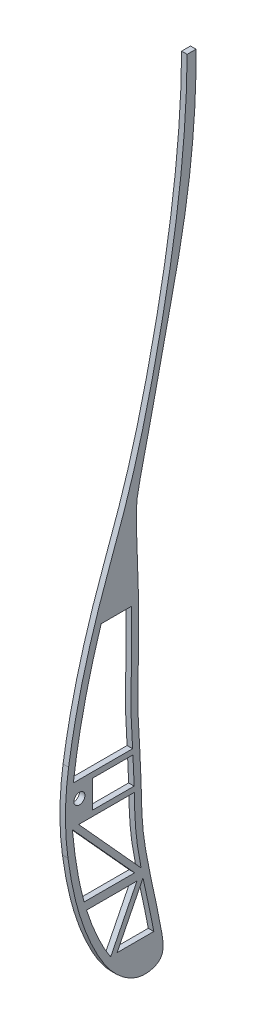
ISO-10303-21;
HEADER;
FILE_DESCRIPTION(('STEP AP214'),'2;1');
FILE_NAME('part.step','',(''),(''),'','','');
FILE_SCHEMA(('AUTOMOTIVE_DESIGN { 1 0 10303 214 1 1 1 1 }'));
ENDSEC;
DATA;
#1=APPLICATION_CONTEXT('core data for automotive mechanical design processes');
#2=APPLICATION_PROTOCOL_DEFINITION('international standard','automotive_design',2000,#1);
#3=PRODUCT_CONTEXT('',#1,'mechanical');
#4=PRODUCT('Part','Part','',(#3));
#5=PRODUCT_RELATED_PRODUCT_CATEGORY('part','',(#4));
#6=PRODUCT_DEFINITION_FORMATION('','',#4);
#7=PRODUCT_DEFINITION_CONTEXT('part definition',#1,'design');
#8=PRODUCT_DEFINITION('design','',#6,#7);
#9=PRODUCT_DEFINITION_SHAPE('','',#8);
#10=(LENGTH_UNIT() NAMED_UNIT(*) SI_UNIT(.MILLI.,.METRE.));
#11=(NAMED_UNIT(*) PLANE_ANGLE_UNIT() SI_UNIT($,.RADIAN.));
#12=(NAMED_UNIT(*) SI_UNIT($,.STERADIAN.) SOLID_ANGLE_UNIT());
#13=UNCERTAINTY_MEASURE_WITH_UNIT(LENGTH_MEASURE(1.E-05),#10,'distance_accuracy_value','');
#14=(GEOMETRIC_REPRESENTATION_CONTEXT(3) GLOBAL_UNCERTAINTY_ASSIGNED_CONTEXT((#13)) GLOBAL_UNIT_ASSIGNED_CONTEXT((#10,
#11,#12)) REPRESENTATION_CONTEXT('',''));
#15=CARTESIAN_POINT('',(0.,0.,0.));
#16=DIRECTION('',(0.,0.,1.));
#17=DIRECTION('',(1.,0.,0.));
#18=AXIS2_PLACEMENT_3D('',#15,#16,#17);
#19=CARTESIAN_POINT('',(2.,487.920198317946,-787.592315755189));
#20=DIRECTION('',(1.,0.,0.));
#21=DIRECTION('',(0.,0.,-1.));
#22=AXIS2_PLACEMENT_3D('',#19,#20,#21);
#23=PLANE('',#22);
#24=CARTESIAN_POINT('',(2.,340.385908262819,-765.512588052985));
#25=CARTESIAN_POINT('',(2.,339.008160637667,-765.942062452033));
#26=CARTESIAN_POINT('',(2.,335.196727706703,-767.22554902468));
#27=CARTESIAN_POINT('',(2.,330.291102646001,-769.261685790927));
#28=CARTESIAN_POINT('',(2.,325.640152405952,-771.608947919703));
#29=CARTESIAN_POINT('',(2.,323.059967565287,-773.096725597255));
#30=CARTESIAN_POINT('',(2.,321.674751511096,-774.004343098112));
#31=CARTESIAN_POINT('',(2.,321.355424184377,-774.220368212697));
#32=B_SPLINE_CURVE_WITH_KNOTS('',3,(#24,#25,#26,#27,#28,#29,#30,#31),.UNSPECIFIED.,.F.,.F.,(4,1,
1,1,1,4),(0.0697506622808374,0.0784831388022607,0.0941020686530699,0.101911533578474,
0.109720998503879,0.112105213874492),.UNSPECIFIED.);
#33=CARTESIAN_POINT('',(2.,340.385908262819,-765.512588052985));
#34=VERTEX_POINT('',#33);
#35=CARTESIAN_POINT('',(2.,321.355424184377,-774.220368212697));
#36=VERTEX_POINT('',#35);
#37=EDGE_CURVE('E254',#34,#36,#32,.T.);
#38=ORIENTED_EDGE('',*,*,#37,.F.);
#39=DIRECTION('',(0.,2.61948278448674E-13,1.));
#40=VECTOR('',#39,1.);
#41=CARTESIAN_POINT('',(2.,340.385908262819,-765.512588052985));
#42=LINE('',#41,#40);
#43=CARTESIAN_POINT('',(2.,340.385908262814,-783.737403402644));
#44=VERTEX_POINT('',#43);
#45=EDGE_CURVE('E262',#44,#34,#42,.T.);
#46=ORIENTED_EDGE('',*,*,#45,.F.);
#47=DIRECTION('',(0.,0.894393478705473,-0.447281013736468));
#48=VECTOR('',#47,1.);
#49=CARTESIAN_POINT('',(2.,340.385908262814,-783.737403402644));
#50=LINE('',#49,#48);
#51=EDGE_CURVE('E261',#36,#44,#50,.T.);
#52=ORIENTED_EDGE('',*,*,#51,.F.);
#53=EDGE_LOOP('',(#38,#46,#52));
#54=FACE_BOUND('',#53,.T.);
#55=DIRECTION('',(0.,0.740403338776906,0.672162849262));
#56=VECTOR('',#55,1.);
#57=CARTESIAN_POINT('',(2.,343.385908235926,-782.893255333231));
#58=LINE('',#57,#56);
#59=CARTESIAN_POINT('',(2.,343.385908235926,-782.893255333231));
#60=VERTEX_POINT('',#59);
#61=CARTESIAN_POINT('',(2.,368.21087997734,-760.356317876787));
#62=VERTEX_POINT('',#61);
#63=EDGE_CURVE('E294',#60,#62,#58,.T.);
#64=ORIENTED_EDGE('',*,*,#63,.F.);
#65=DIRECTION('',(0.,0.,-1.));
#66=VECTOR('',#65,1.);
#67=CARTESIAN_POINT('',(2.,343.385908235926,-764.629795023823));
#68=LINE('',#67,#66);
#69=CARTESIAN_POINT('',(2.,343.385908235926,-764.629795023823));
#70=VERTEX_POINT('',#69);
#71=EDGE_CURVE('E292',#70,#60,#68,.T.);
#72=ORIENTED_EDGE('',*,*,#71,.F.);
#73=CARTESIAN_POINT('',(2.,368.21087997734,-760.356317876787));
#74=CARTESIAN_POINT('',(2.,365.108328869822,-760.645542864691));
#75=CARTESIAN_POINT('',(2.,359.399798980375,-761.297099333512));
#76=CARTESIAN_POINT('',(2.,351.207948443267,-762.68556128646));
#77=CARTESIAN_POINT('',(2.,346.064289496861,-763.890877385841));
#78=CARTESIAN_POINT('',(2.,343.478926304313,-764.603996250646));
#79=CARTESIAN_POINT('',(2.,343.385908235926,-764.629795023823));
#80=B_SPLINE_CURVE_WITH_KNOTS('',3,(#73,#74,#75,#76,#77,#78,#79),.UNSPECIFIED.,.F.,.F.,(4,1,1,1,
4),(0.0131300298220132,0.0316263492498333,0.0472452791006425,0.0628642089514516,
0.0634474168728754),.UNSPECIFIED.);
#81=EDGE_CURVE('E298',#62,#70,#80,.T.);
#82=ORIENTED_EDGE('',*,*,#81,.F.);
#83=EDGE_LOOP('',(#64,#72,#82));
#84=FACE_BOUND('',#83,.T.);
#85=DIRECTION('',(0.,1.01853799677728E-12,1.));
#86=VECTOR('',#85,1.);
#87=CARTESIAN_POINT('',(2.,368.641580619222,-762.664726398492));
#88=LINE('',#87,#86);
#89=CARTESIAN_POINT('',(2.,368.641580619201,-782.775527241608));
#90=VERTEX_POINT('',#89);
#91=CARTESIAN_POINT('',(2.,368.641580619222,-762.664726398492));
#92=VERTEX_POINT('',#91);
#93=EDGE_CURVE('E341',#90,#92,#88,.T.);
#94=ORIENTED_EDGE('',*,*,#93,.F.);
#95=CARTESIAN_POINT('',(2.,343.762046236129,-785.235370081016));
#96=CARTESIAN_POINT('',(2.,345.435849463041,-784.911737530117));
#97=CARTESIAN_POINT('',(2.,348.412605531152,-784.369480265457));
#98=CARTESIAN_POINT('',(2.,352.846020065377,-783.683400446278));
#99=CARTESIAN_POINT('',(2.,358.350652792847,-783.092319970369));
#100=CARTESIAN_POINT('',(2.,363.61967757603,-782.886598012818));
#101=CARTESIAN_POINT('',(2.,367.500970974052,-782.801054430297));
#102=CARTESIAN_POINT('',(2.,368.641580619201,-782.775527241608));
#103=B_SPLINE_CURVE_WITH_KNOTS('',3,(#95,#96,#97,#98,#99,#100,#101,#102),.UNSPECIFIED.,.F.,.F.,
(4,1,1,1,1,4),(0.224345048321059,0.234672437310352,0.242481902235757,0.250291367161161,
0.26591029701197,0.272429812364704),.UNSPECIFIED.);
#104=CARTESIAN_POINT('',(2.,343.762046236129,-785.235370081016));
#105=VERTEX_POINT('',#104);
#106=EDGE_CURVE('E335',#105,#90,#103,.T.);
#107=ORIENTED_EDGE('',*,*,#106,.F.);
#108=DIRECTION('',(0.,-0.74063778163558,-0.671904514357454));
#109=VECTOR('',#108,1.);
#110=CARTESIAN_POINT('',(2.,343.762046236129,-785.235370081016));
#111=LINE('',#110,#109);
#112=EDGE_CURVE('E350',#92,#105,#111,.T.);
#113=ORIENTED_EDGE('',*,*,#112,.F.);
#114=EDGE_LOOP('',(#94,#107,#113));
#115=FACE_BOUND('',#114,.T.);
#116=DIRECTION('',(0.,-0.894393513688275,0.44728094378404));
#117=VECTOR('',#116,1.);
#118=CARTESIAN_POINT('',(2.,340.297979165982,-785.929582763325));
#119=LINE('',#118,#117);
#120=CARTESIAN_POINT('',(2.,340.297979165982,-785.929582763325));
#121=VERTEX_POINT('',#120);
#122=CARTESIAN_POINT('',(2.,321.529397961903,-776.543525523454));
#123=VERTEX_POINT('',#122);
#124=EDGE_CURVE('E379',#121,#123,#119,.T.);
#125=ORIENTED_EDGE('',*,*,#124,.F.);
#126=CARTESIAN_POINT('',(2.,321.529397961903,-789.845927053336));
#127=CARTESIAN_POINT('',(2.,321.699503823298,-789.814167011017));
#128=CARTESIAN_POINT('',(2.,322.038893566124,-789.750428920361));
#129=CARTESIAN_POINT('',(2.,323.580698572305,-789.457737754349));
#130=CARTESIAN_POINT('',(2.,326.240421286965,-788.929454000009));
#131=CARTESIAN_POINT('',(2.,329.952624524179,-788.149638114499));
#132=CARTESIAN_POINT('',(2.,333.72403688345,-787.332530561591));
#133=CARTESIAN_POINT('',(2.,337.157851053267,-786.588165074445));
#134=CARTESIAN_POINT('',(2.,339.349407118532,-786.125599329134));
#135=CARTESIAN_POINT('',(2.,340.297979165982,-785.929582763325));
#136=B_SPLINE_CURVE_WITH_KNOTS('',3,(#126,#127,#128,#129,#130,#131,#132,#133,#134,#135),
.UNSPECIFIED.,.F.,.F.,(4,1,1,1,1,1,1,4),(0.178917784035079,0.179893967151298,0.180870150266974,
0.187815647757925,0.195625112683329,0.203434577608734,0.211244042534138,0.217170107358208),.UNSPECIFIED.);
#137=CARTESIAN_POINT('',(2.,321.529397961903,-789.845927053336));
#138=VERTEX_POINT('',#137);
#139=EDGE_CURVE('E374',#138,#121,#136,.T.);
#140=ORIENTED_EDGE('',*,*,#139,.F.);
#141=DIRECTION('',(0.,0.,-1.));
#142=VECTOR('',#141,1.);
#143=CARTESIAN_POINT('',(2.,321.529397961903,-776.543525523454));
#144=LINE('',#143,#142);
#145=EDGE_CURVE('E513',#123,#138,#144,.T.);
#146=ORIENTED_EDGE('',*,*,#145,.F.);
#147=EDGE_LOOP('',(#125,#140,#146));
#148=FACE_BOUND('',#147,.T.);
#149=DIRECTION('',(0.,0.,-1.));
#150=VECTOR('',#149,1.);
#151=CARTESIAN_POINT('',(2.,382.641580619201,-760.713816226627));
#152=LINE('',#151,#150);
#153=CARTESIAN_POINT('',(2.,382.641580619201,-760.713816226627));
#154=VERTEX_POINT('',#153);
#155=CARTESIAN_POINT('',(2.,382.641580619201,-782.158524772029));
#156=VERTEX_POINT('',#155);
#157=EDGE_CURVE('E410',#154,#156,#152,.T.);
#158=ORIENTED_EDGE('',*,*,#157,.F.);
#159=CARTESIAN_POINT('',(2.,427.491820966125,-770.78664309846));
#160=CARTESIAN_POINT('',(2.,423.33866525662,-769.467056163945));
#161=CARTESIAN_POINT('',(2.,414.7700614056,-766.964736871384));
#162=CARTESIAN_POINT('',(2.,399.851527625685,-763.380449780048));
#163=CARTESIAN_POINT('',(2.,389.014059475878,-761.525068294202));
#164=CARTESIAN_POINT('',(2.,382.641580619201,-760.713816226627));
#165=B_SPLINE_CURVE_WITH_KNOTS('',3,(#159,#160,#161,#162,#163,#164),.UNSPECIFIED.,.F.,.F.,(4,1,
1,4),(0.75216752707801,0.811772657665889,0.874216708255573,0.962264248056751),.UNSPECIFIED.);
#166=CARTESIAN_POINT('',(2.,427.491820966125,-770.78664309846));
#167=VERTEX_POINT('',#166);
#168=EDGE_CURVE('E440',#167,#154,#165,.T.);
#169=ORIENTED_EDGE('',*,*,#168,.F.);
#170=DIRECTION('',(0.,0.,1.));
#171=VECTOR('',#170,1.);
#172=CARTESIAN_POINT('',(2.,427.491820966125,-770.78664309846));
#173=LINE('',#172,#171);
#174=CARTESIAN_POINT('',(2.,427.491820966125,-781.8143913991));
#175=VERTEX_POINT('',#174);
#176=EDGE_CURVE('E409',#175,#167,#173,.T.);
#177=ORIENTED_EDGE('',*,*,#176,.F.);
#178=CARTESIAN_POINT('',(2.,382.641580619201,-782.158524772029));
#179=CARTESIAN_POINT('',(2.,384.984999743043,-782.009801346982));
#180=CARTESIAN_POINT('',(2.,392.72879678058,-781.532269832097));
#181=CARTESIAN_POINT('',(2.,402.504492041581,-781.601558596643));
#182=CARTESIAN_POINT('',(2.,413.028444882909,-781.812144771197));
#183=CARTESIAN_POINT('',(2.,420.046613203179,-781.889539878955));
#184=CARTESIAN_POINT('',(2.,425.00787778219,-781.856336873659));
#185=CARTESIAN_POINT('',(2.,427.030653456843,-781.822920811895));
#186=CARTESIAN_POINT('',(2.,427.491820966125,-781.8143913991));
#187=B_SPLINE_CURVE_WITH_KNOTS('',3,(#178,#179,#180,#181,#182,#183,#184,#185,#186),
.UNSPECIFIED.,.F.,.F.,(4,1,1,1,1,1,4),(0.299279434855956,0.312767086564398,0.344004946266016,
0.359623876116825,0.375242805967634,0.383052270893039,0.385336265488092),.UNSPECIFIED.);
#188=EDGE_CURVE('E402',#156,#175,#187,.T.);
#189=ORIENTED_EDGE('',*,*,#188,.F.);
#190=EDGE_LOOP('',(#158,#169,#177,#189));
#191=FACE_BOUND('',#190,.T.);
#192=CARTESIAN_POINT('',(2.,590.408064710771,-801.906188373582));
#193=CARTESIAN_POINT('',(2.,560.152088887288,-801.696570251293));
#194=CARTESIAN_POINT('',(2.,516.437326180136,-794.99876359232));
#195=CARTESIAN_POINT('',(2.,464.922101840584,-781.936935881535));
#196=CARTESIAN_POINT('',(2.,434.335812649186,-769.954968016458));
#197=CARTESIAN_POINT('',(2.,410.299032990524,-762.960296942413));
#198=CARTESIAN_POINT('',(2.,394.5014570022,-759.91934012317));
#199=CARTESIAN_POINT('',(2.,388.426895833706,-758.997230435459));
#200=B_SPLINE_CURVE_WITH_KNOTS('',3,(#192,#193,#194,#195,#196,#197,#198,#199),.UNSPECIFIED.,.F.,
.F.,(4,1,1,1,1,4),(0.,0.408822914051853,0.598513203717909,0.719261823921423,0.854060705268453,
0.937350513563484),.UNSPECIFIED.);
#201=CARTESIAN_POINT('',(2.,590.408064710771,-801.906188373582));
#202=VERTEX_POINT('',#201);
#203=CARTESIAN_POINT('',(2.,388.426895833706,-758.997230435459));
#204=VERTEX_POINT('',#203);
#205=EDGE_CURVE('E450',#202,#204,#200,.T.);
#206=ORIENTED_EDGE('',*,*,#205,.T.);
#207=CARTESIAN_POINT('',(2.,373.418966627961,-857.864626785092));
#208=DIRECTION('',(1.,0.,0.));
#209=DIRECTION('',(0.,0.,-1.));
#210=AXIS2_PLACEMENT_3D('',#207,#208,#209);
#211=CIRCLE('',#210,100.);
#212=CARTESIAN_POINT('',(2.,360.06570641665,-758.760184696308));
#213=VERTEX_POINT('',#212);
#214=EDGE_CURVE('E456',#204,#213,#211,.T.);
#215=ORIENTED_EDGE('',*,*,#214,.T.);
#216=CARTESIAN_POINT('',(2.,360.06570641665,-758.760184696308));
#217=CARTESIAN_POINT('',(2.,354.912593588328,-759.454511358611));
#218=CARTESIAN_POINT('',(2.,342.91803163055,-761.639215143785));
#219=CARTESIAN_POINT('',(2.,326.356505876886,-767.602503807591));
#220=CARTESIAN_POINT('',(2.,313.183311775306,-776.364446291571));
#221=CARTESIAN_POINT('',(2.,308.841980468107,-785.880697371213));
#222=CARTESIAN_POINT('',(2.,310.610251685068,-791.313928595472));
#223=CARTESIAN_POINT('',(2.,312.987941846461,-793.075385029442));
#224=CARTESIAN_POINT('',(2.,316.107743129073,-793.337462446663));
#225=CARTESIAN_POINT('',(2.,329.643146103394,-791.041438182055));
#226=CARTESIAN_POINT('',(2.,341.196605560739,-787.95599236507));
#227=CARTESIAN_POINT('',(2.,359.620713161168,-785.204159750693));
#228=CARTESIAN_POINT('',(2.,372.997065252505,-785.453788794671));
#229=CARTESIAN_POINT('',(2.,397.430131693857,-783.431517771397));
#230=CARTESIAN_POINT('',(2.,420.762517316124,-785.24761534817));
#231=CARTESIAN_POINT('',(2.,455.809656019197,-783.053458862603));
#232=CARTESIAN_POINT('',(2.,464.386743167617,-784.469445240221));
#233=CARTESIAN_POINT('',(2.,479.293540681458,-788.132816832003));
#234=CARTESIAN_POINT('',(2.,503.980467437628,-793.242767846079));
#235=CARTESIAN_POINT('',(2.,542.605359529919,-802.54005693684));
#236=CARTESIAN_POINT('',(2.,572.394099522504,-805.258661066609));
#237=CARTESIAN_POINT('',(2.,590.408064710771,-805.114959311522));
#238=B_SPLINE_CURVE_WITH_KNOTS('',3,(#216,#217,#218,#219,#220,#221,#222,#223,#224,#225,#226,
#227,#228,#229,#230,#231,#232,#233,#234,#235,#236,#237),.UNSPECIFIED.,.F.,.F.,(4,1,1,1,1,1,1,1,
1,1,1,1,1,1,1,1,1,1,1,4),(0.0287053793644798,0.0592468566198316,0.100347506498937,
0.132199535267225,0.149145767340533,0.158795902968277,0.160733944755249,0.167660380715246,
0.175846516855138,0.234409170014273,0.24607012832152,0.285135768282719,0.310616456213291,
0.385264397934258,0.441942427351935,0.454032525104892,0.506165375463829,0.624061375943607,
0.777474310688583,1.),.UNSPECIFIED.);
#239=CARTESIAN_POINT('',(2.,590.408064710771,-805.114959311522));
#240=VERTEX_POINT('',#239);
#241=EDGE_CURVE('E462',#213,#240,#238,.T.);
#242=ORIENTED_EDGE('',*,*,#241,.T.);
#243=DIRECTION('',(0.,0.,1.));
#244=VECTOR('',#243,1.);
#245=CARTESIAN_POINT('',(2.,590.408064710771,-801.906188373582));
#246=LINE('',#245,#244);
#247=EDGE_CURVE('E467',#240,#202,#246,.T.);
#248=ORIENTED_EDGE('',*,*,#247,.T.);
#249=EDGE_LOOP('',(#206,#215,#242,#248));
#250=FACE_BOUND('',#249,.T.);
#251=CARTESIAN_POINT('',(2.,376.641580619201,-762.916566478433));
#252=DIRECTION('',(1.,0.,0.));
#253=DIRECTION('',(0.,0.,-1.));
#254=AXIS2_PLACEMENT_3D('',#251,#252,#253);
#255=CIRCLE('',#254,2.);
#256=CARTESIAN_POINT('',(2.,376.641580619201,-764.916566478433));
#257=VERTEX_POINT('',#256);
#258=EDGE_CURVE('E273',#257,#257,#255,.T.);
#259=ORIENTED_EDGE('',*,*,#258,.F.);
#260=EDGE_LOOP('',(#259));
#261=FACE_BOUND('',#260,.T.);
#262=DIRECTION('',(0.,-1.,0.));
#263=VECTOR('',#262,1.);
#264=CARTESIAN_POINT('',(2.,380.641580619201,-767.571939026823));
#265=LINE('',#264,#263);
#266=CARTESIAN_POINT('',(2.,380.641580619201,-767.571939026823));
#267=VERTEX_POINT('',#266);
#268=CARTESIAN_POINT('',(2.,370.641580619201,-767.571939026823));
#269=VERTEX_POINT('',#268);
#270=EDGE_CURVE('E202',#267,#269,#265,.T.);
#271=ORIENTED_EDGE('',*,*,#270,.F.);
#272=DIRECTION('',(0.,0.,1.));
#273=VECTOR('',#272,1.);
#274=CARTESIAN_POINT('',(2.,380.641580619201,-767.571939026823));
#275=LINE('',#274,#273);
#276=CARTESIAN_POINT('',(2.,380.641580619201,-782.28548229842));
#277=VERTEX_POINT('',#276);
#278=EDGE_CURVE('E194',#277,#267,#275,.T.);
#279=ORIENTED_EDGE('',*,*,#278,.F.);
#280=CARTESIAN_POINT('',(2.,370.641580619201,-782.729137506047));
#281=CARTESIAN_POINT('',(2.,371.563392328796,-782.706435659239));
#282=CARTESIAN_POINT('',(2.,373.842636010294,-782.643817690012));
#283=CARTESIAN_POINT('',(2.,377.160810260957,-782.499614967796));
#284=CARTESIAN_POINT('',(2.,379.579890206761,-782.352274740881));
#285=CARTESIAN_POINT('',(2.,380.641580619201,-782.28548229842));
#286=B_SPLINE_CURVE_WITH_KNOTS('',3,(#280,#281,#282,#283,#284,#285),.UNSPECIFIED.,.F.,.F.,(4,1,
1,4),(0.276245485102746,0.28152922686278,0.289338691788184,0.295444603811265),.UNSPECIFIED.);
#287=CARTESIAN_POINT('',(2.,370.641580619201,-782.729137506047));
#288=VERTEX_POINT('',#287);
#289=EDGE_CURVE('E216',#288,#277,#286,.T.);
#290=ORIENTED_EDGE('',*,*,#289,.F.);
#291=DIRECTION('',(0.,0.,-1.));
#292=VECTOR('',#291,1.);
#293=CARTESIAN_POINT('',(2.,370.641580619201,-767.571939026823));
#294=LINE('',#293,#292);
#295=EDGE_CURVE('E214',#269,#288,#294,.T.);
#296=ORIENTED_EDGE('',*,*,#295,.F.);
#297=EDGE_LOOP('',(#271,#279,#290,#296));
#298=FACE_BOUND('',#297,.T.);
#299=ADVANCED_FACE('F32',(#54,#84,#115,#148,#191,#250,#261,#298),#23,.T.);
#300=CARTESIAN_POINT('',(0.,487.920198317946,-787.592315755189));
#301=DIRECTION('',(1.,0.,0.));
#302=DIRECTION('',(0.,0.,-1.));
#303=AXIS2_PLACEMENT_3D('',#300,#301,#302);
#304=PLANE('',#303);
#305=CARTESIAN_POINT('',(0.,376.641580619201,-762.916566478433));
#306=DIRECTION('',(1.,0.,0.));
#307=DIRECTION('',(0.,0.,-1.));
#308=AXIS2_PLACEMENT_3D('',#305,#306,#307);
#309=CIRCLE('',#308,2.);
#310=CARTESIAN_POINT('',(0.,376.641580619201,-764.916566478433));
#311=VERTEX_POINT('',#310);
#312=EDGE_CURVE('E210',#311,#311,#309,.T.);
#313=ORIENTED_EDGE('',*,*,#312,.T.);
#314=EDGE_LOOP('',(#313));
#315=FACE_BOUND('',#314,.T.);
#316=DIRECTION('',(0.,2.61948278448674E-13,1.));
#317=VECTOR('',#316,1.);
#318=CARTESIAN_POINT('',(0.,340.385908262819,-765.512588052985));
#319=LINE('',#318,#317);
#320=CARTESIAN_POINT('',(0.,340.385908262814,-783.737403402644));
#321=VERTEX_POINT('',#320);
#322=CARTESIAN_POINT('',(0.,340.385908262819,-765.512588052985));
#323=VERTEX_POINT('',#322);
#324=EDGE_CURVE('E269',#321,#323,#319,.T.);
#325=ORIENTED_EDGE('',*,*,#324,.T.);
#326=CARTESIAN_POINT('',(0.,340.385908262819,-765.512588052985));
#327=CARTESIAN_POINT('',(0.,339.008160637667,-765.942062452033));
#328=CARTESIAN_POINT('',(0.,335.196727706703,-767.22554902468));
#329=CARTESIAN_POINT('',(0.,330.291102646001,-769.261685790927));
#330=CARTESIAN_POINT('',(0.,325.640152405952,-771.608947919703));
#331=CARTESIAN_POINT('',(0.,323.059967565287,-773.096725597255));
#332=CARTESIAN_POINT('',(0.,321.674751511096,-774.004343098112));
#333=CARTESIAN_POINT('',(0.,321.355424184377,-774.220368212697));
#334=B_SPLINE_CURVE_WITH_KNOTS('',3,(#326,#327,#328,#329,#330,#331,#332,#333),.UNSPECIFIED.,.F.,
.F.,(4,1,1,1,1,4),(0.0697506622808374,0.0784831388022607,0.0941020686530699,0.101911533578474,
0.109720998503879,0.112105213874492),.UNSPECIFIED.);
#335=CARTESIAN_POINT('',(0.,321.355424184377,-774.220368212697));
#336=VERTEX_POINT('',#335);
#337=EDGE_CURVE('E272',#323,#336,#334,.T.);
#338=ORIENTED_EDGE('',*,*,#337,.T.);
#339=DIRECTION('',(0.,0.894393478705473,-0.447281013736468));
#340=VECTOR('',#339,1.);
#341=CARTESIAN_POINT('',(0.,340.385908262814,-783.737403402644));
#342=LINE('',#341,#340);
#343=EDGE_CURVE('E278',#336,#321,#342,.T.);
#344=ORIENTED_EDGE('',*,*,#343,.T.);
#345=EDGE_LOOP('',(#325,#338,#344));
#346=FACE_BOUND('',#345,.T.);
#347=CARTESIAN_POINT('',(0.,343.762046236129,-785.235370081016));
#348=CARTESIAN_POINT('',(0.,345.435849463041,-784.911737530117));
#349=CARTESIAN_POINT('',(0.,348.412605531152,-784.369480265457));
#350=CARTESIAN_POINT('',(0.,352.846020065377,-783.683400446278));
#351=CARTESIAN_POINT('',(0.,358.350652792847,-783.092319970369));
#352=CARTESIAN_POINT('',(0.,363.61967757603,-782.886598012818));
#353=CARTESIAN_POINT('',(0.,367.500970974052,-782.801054430297));
#354=CARTESIAN_POINT('',(0.,368.641580619201,-782.775527241608));
#355=B_SPLINE_CURVE_WITH_KNOTS('',3,(#347,#348,#349,#350,#351,#352,#353,#354),.UNSPECIFIED.,.F.,
.F.,(4,1,1,1,1,4),(0.224345048321059,0.234672437310352,0.242481902235757,0.250291367161161,
0.26591029701197,0.272429812364704),.UNSPECIFIED.);
#356=CARTESIAN_POINT('',(0.,343.762046236129,-785.235370081016));
#357=VERTEX_POINT('',#356);
#358=CARTESIAN_POINT('',(0.,368.641580619201,-782.775527241608));
#359=VERTEX_POINT('',#358);
#360=EDGE_CURVE('E353',#357,#359,#355,.T.);
#361=ORIENTED_EDGE('',*,*,#360,.T.);
#362=DIRECTION('',(0.,1.01853799677728E-12,1.));
#363=VECTOR('',#362,1.);
#364=CARTESIAN_POINT('',(0.,368.641580619222,-762.664726398492));
#365=LINE('',#364,#363);
#366=CARTESIAN_POINT('',(0.,368.641580619222,-762.664726398492));
#367=VERTEX_POINT('',#366);
#368=EDGE_CURVE('E358',#359,#367,#365,.T.);
#369=ORIENTED_EDGE('',*,*,#368,.T.);
#370=DIRECTION('',(0.,-0.74063778163558,-0.671904514357454));
#371=VECTOR('',#370,1.);
#372=CARTESIAN_POINT('',(0.,343.762046236129,-785.235370081016));
#373=LINE('',#372,#371);
#374=EDGE_CURVE('E342',#367,#357,#373,.T.);
#375=ORIENTED_EDGE('',*,*,#374,.T.);
#376=EDGE_LOOP('',(#361,#369,#375));
#377=FACE_BOUND('',#376,.T.);
#378=CARTESIAN_POINT('',(0.,427.491820966125,-770.78664309846));
#379=CARTESIAN_POINT('',(0.,423.33866525662,-769.467056163945));
#380=CARTESIAN_POINT('',(0.,414.7700614056,-766.964736871384));
#381=CARTESIAN_POINT('',(0.,399.851527625685,-763.380449780048));
#382=CARTESIAN_POINT('',(0.,389.014059475878,-761.525068294202));
#383=CARTESIAN_POINT('',(0.,382.641580619201,-760.713816226627));
#384=B_SPLINE_CURVE_WITH_KNOTS('',3,(#378,#379,#380,#381,#382,#383),.UNSPECIFIED.,.F.,.F.,(4,1,
1,4),(0.75216752707801,0.811772657665889,0.874216708255573,0.962264248056751),.UNSPECIFIED.);
#385=CARTESIAN_POINT('',(0.,427.491820966125,-770.78664309846));
#386=VERTEX_POINT('',#385);
#387=CARTESIAN_POINT('',(0.,382.641580619201,-760.713816226627));
#388=VERTEX_POINT('',#387);
#389=EDGE_CURVE('E417',#386,#388,#384,.T.);
#390=ORIENTED_EDGE('',*,*,#389,.T.);
#391=DIRECTION('',(0.,0.,-1.));
#392=VECTOR('',#391,1.);
#393=CARTESIAN_POINT('',(0.,382.641580619201,-760.713816226627));
#394=LINE('',#393,#392);
#395=CARTESIAN_POINT('',(0.,382.641580619201,-782.158524772029));
#396=VERTEX_POINT('',#395);
#397=EDGE_CURVE('E422',#388,#396,#394,.T.);
#398=ORIENTED_EDGE('',*,*,#397,.T.);
#399=CARTESIAN_POINT('',(0.,382.641580619201,-782.158524772029));
#400=CARTESIAN_POINT('',(0.,384.984999743043,-782.009801346982));
#401=CARTESIAN_POINT('',(0.,392.72879678058,-781.532269832097));
#402=CARTESIAN_POINT('',(0.,402.504492041581,-781.601558596643));
#403=CARTESIAN_POINT('',(0.,413.028444882909,-781.812144771197));
#404=CARTESIAN_POINT('',(0.,420.046613203179,-781.889539878955));
#405=CARTESIAN_POINT('',(0.,425.00787778219,-781.856336873659));
#406=CARTESIAN_POINT('',(0.,427.030653456843,-781.822920811895));
#407=CARTESIAN_POINT('',(0.,427.491820966125,-781.8143913991));
#408=B_SPLINE_CURVE_WITH_KNOTS('',3,(#399,#400,#401,#402,#403,#404,#405,#406,#407),
.UNSPECIFIED.,.F.,.F.,(4,1,1,1,1,1,4),(0.299279434855956,0.312767086564398,0.344004946266016,
0.359623876116825,0.375242805967634,0.383052270893039,0.385336265488092),.UNSPECIFIED.);
#409=CARTESIAN_POINT('',(0.,427.491820966125,-781.8143913991));
#410=VERTEX_POINT('',#409);
#411=EDGE_CURVE('E429',#396,#410,#408,.T.);
#412=ORIENTED_EDGE('',*,*,#411,.T.);
#413=DIRECTION('',(0.,0.,1.));
#414=VECTOR('',#413,1.);
#415=CARTESIAN_POINT('',(0.,427.491820966125,-770.78664309846));
#416=LINE('',#415,#414);
#417=EDGE_CURVE('E434',#410,#386,#416,.T.);
#418=ORIENTED_EDGE('',*,*,#417,.T.);
#419=EDGE_LOOP('',(#390,#398,#412,#418));
#420=FACE_BOUND('',#419,.T.);
#421=CARTESIAN_POINT('',(0.,590.408064710771,-801.906188373582));
#422=CARTESIAN_POINT('',(0.,560.152088887288,-801.696570251293));
#423=CARTESIAN_POINT('',(0.,516.437326180136,-794.99876359232));
#424=CARTESIAN_POINT('',(0.,464.922101840584,-781.936935881535));
#425=CARTESIAN_POINT('',(0.,434.335812649186,-769.954968016458));
#426=CARTESIAN_POINT('',(0.,410.299032990524,-762.960296942413));
#427=CARTESIAN_POINT('',(0.,394.5014570022,-759.91934012317));
#428=CARTESIAN_POINT('',(0.,388.426895833706,-758.997230435459));
#429=B_SPLINE_CURVE_WITH_KNOTS('',3,(#421,#422,#423,#424,#425,#426,#427,#428),.UNSPECIFIED.,.F.,
.F.,(4,1,1,1,1,4),(0.,0.408822914051853,0.598513203717909,0.719261823921423,0.854060705268453,
0.937350513563484),.UNSPECIFIED.);
#430=CARTESIAN_POINT('',(0.,590.408064710771,-801.906188373582));
#431=VERTEX_POINT('',#430);
#432=CARTESIAN_POINT('',(0.,388.426895833706,-758.997230435459));
#433=VERTEX_POINT('',#432);
#434=EDGE_CURVE('E449',#431,#433,#429,.T.);
#435=ORIENTED_EDGE('',*,*,#434,.F.);
#436=DIRECTION('',(0.,0.,1.));
#437=VECTOR('',#436,1.);
#438=CARTESIAN_POINT('',(0.,590.408064710771,-801.906188373582));
#439=LINE('',#438,#437);
#440=CARTESIAN_POINT('',(0.,590.408064710771,-805.114959311522));
#441=VERTEX_POINT('',#440);
#442=EDGE_CURVE('E457',#441,#431,#439,.T.);
#443=ORIENTED_EDGE('',*,*,#442,.F.);
#444=CARTESIAN_POINT('',(0.,360.06570641665,-758.760184696308));
#445=CARTESIAN_POINT('',(0.,354.912593588328,-759.454511358611));
#446=CARTESIAN_POINT('',(0.,342.91803163055,-761.639215143785));
#447=CARTESIAN_POINT('',(0.,326.356505876886,-767.602503807591));
#448=CARTESIAN_POINT('',(0.,313.183311775306,-776.364446291571));
#449=CARTESIAN_POINT('',(0.,308.841980468107,-785.880697371213));
#450=CARTESIAN_POINT('',(0.,310.610251685068,-791.313928595472));
#451=CARTESIAN_POINT('',(0.,312.987941846461,-793.075385029442));
#452=CARTESIAN_POINT('',(0.,316.107743129073,-793.337462446663));
#453=CARTESIAN_POINT('',(0.,329.643146103394,-791.041438182055));
#454=CARTESIAN_POINT('',(0.,341.196605560739,-787.95599236507));
#455=CARTESIAN_POINT('',(0.,359.620713161168,-785.204159750693));
#456=CARTESIAN_POINT('',(0.,372.997065252505,-785.453788794671));
#457=CARTESIAN_POINT('',(0.,397.430131693857,-783.431517771397));
#458=CARTESIAN_POINT('',(0.,420.762517316124,-785.24761534817));
#459=CARTESIAN_POINT('',(0.,455.809656019197,-783.053458862603));
#460=CARTESIAN_POINT('',(0.,464.386743167617,-784.469445240221));
#461=CARTESIAN_POINT('',(0.,479.293540681458,-788.132816832003));
#462=CARTESIAN_POINT('',(0.,503.980467437628,-793.242767846079));
#463=CARTESIAN_POINT('',(0.,542.605359529919,-802.54005693684));
#464=CARTESIAN_POINT('',(0.,572.394099522504,-805.258661066609));
#465=CARTESIAN_POINT('',(0.,590.408064710771,-805.114959311522));
#466=B_SPLINE_CURVE_WITH_KNOTS('',3,(#444,#445,#446,#447,#448,#449,#450,#451,#452,#453,#454,
#455,#456,#457,#458,#459,#460,#461,#462,#463,#464,#465),.UNSPECIFIED.,.F.,.F.,(4,1,1,1,1,1,1,1,
1,1,1,1,1,1,1,1,1,1,1,4),(0.0287053793644798,0.0592468566198316,0.100347506498937,
0.132199535267225,0.149145767340533,0.158795902968277,0.160733944755249,0.167660380715246,
0.175846516855138,0.234409170014273,0.24607012832152,0.285135768282719,0.310616456213291,
0.385264397934258,0.441942427351935,0.454032525104892,0.506165375463829,0.624061375943607,
0.777474310688583,1.),.UNSPECIFIED.);
#467=CARTESIAN_POINT('',(0.,360.06570641665,-758.760184696308));
#468=VERTEX_POINT('',#467);
#469=EDGE_CURVE('E571',#468,#441,#466,.T.);
#470=ORIENTED_EDGE('',*,*,#469,.F.);
#471=CARTESIAN_POINT('',(0.,373.418966627961,-857.864626785092));
#472=DIRECTION('',(1.,0.,0.));
#473=DIRECTION('',(0.,0.,-1.));
#474=AXIS2_PLACEMENT_3D('',#471,#472,#473);
#475=CIRCLE('',#474,100.);
#476=EDGE_CURVE('E568',#433,#468,#475,.T.);
#477=ORIENTED_EDGE('',*,*,#476,.F.);
#478=EDGE_LOOP('',(#435,#443,#470,#477));
#479=FACE_BOUND('',#478,.T.);
#480=CARTESIAN_POINT('',(0.,321.529397961903,-789.845927053336));
#481=CARTESIAN_POINT('',(0.,321.699503823298,-789.814167011017));
#482=CARTESIAN_POINT('',(0.,322.038893566124,-789.750428920361));
#483=CARTESIAN_POINT('',(0.,323.580698572305,-789.457737754349));
#484=CARTESIAN_POINT('',(0.,326.240421286965,-788.929454000009));
#485=CARTESIAN_POINT('',(0.,329.952624524179,-788.149638114499));
#486=CARTESIAN_POINT('',(0.,333.72403688345,-787.332530561591));
#487=CARTESIAN_POINT('',(0.,337.157851053267,-786.588165074445));
#488=CARTESIAN_POINT('',(0.,339.349407118532,-786.125599329134));
#489=CARTESIAN_POINT('',(0.,340.297979165982,-785.929582763325));
#490=B_SPLINE_CURVE_WITH_KNOTS('',3,(#480,#481,#482,#483,#484,#485,#486,#487,#488,#489),
.UNSPECIFIED.,.F.,.F.,(4,1,1,1,1,1,1,4),(0.178917784035079,0.179893967151298,0.180870150266974,
0.187815647757925,0.195625112683329,0.203434577608734,0.211244042534138,0.217170107358208),.UNSPECIFIED.);
#491=CARTESIAN_POINT('',(0.,321.529397961903,-789.845927053336));
#492=VERTEX_POINT('',#491);
#493=CARTESIAN_POINT('',(0.,340.297979165982,-785.929582763325));
#494=VERTEX_POINT('',#493);
#495=EDGE_CURVE('E373',#492,#494,#490,.T.);
#496=ORIENTED_EDGE('',*,*,#495,.T.);
#497=DIRECTION('',(0.,-0.894393513688275,0.44728094378404));
#498=VECTOR('',#497,1.);
#499=CARTESIAN_POINT('',(0.,340.297979165982,-785.929582763325));
#500=LINE('',#499,#498);
#501=CARTESIAN_POINT('',(0.,321.529397961903,-776.543525523454));
#502=VERTEX_POINT('',#501);
#503=EDGE_CURVE('E516',#494,#502,#500,.T.);
#504=ORIENTED_EDGE('',*,*,#503,.T.);
#505=DIRECTION('',(0.,0.,-1.));
#506=VECTOR('',#505,1.);
#507=CARTESIAN_POINT('',(0.,321.529397961903,-776.543525523454));
#508=LINE('',#507,#506);
#509=EDGE_CURVE('E380',#502,#492,#508,.T.);
#510=ORIENTED_EDGE('',*,*,#509,.T.);
#511=EDGE_LOOP('',(#496,#504,#510));
#512=FACE_BOUND('',#511,.T.);
#513=DIRECTION('',(0.,0.,-1.));
#514=VECTOR('',#513,1.);
#515=CARTESIAN_POINT('',(0.,343.385908235926,-764.629795023823));
#516=LINE('',#515,#514);
#517=CARTESIAN_POINT('',(0.,343.385908235926,-764.629795023823));
#518=VERTEX_POINT('',#517);
#519=CARTESIAN_POINT('',(0.,343.385908235926,-782.893255333231));
#520=VERTEX_POINT('',#519);
#521=EDGE_CURVE('E291',#518,#520,#516,.T.);
#522=ORIENTED_EDGE('',*,*,#521,.T.);
#523=DIRECTION('',(0.,0.740403338776906,0.672162849262));
#524=VECTOR('',#523,1.);
#525=CARTESIAN_POINT('',(0.,343.385908235926,-782.893255333231));
#526=LINE('',#525,#524);
#527=CARTESIAN_POINT('',(0.,368.21087997734,-760.356317876787));
#528=VERTEX_POINT('',#527);
#529=EDGE_CURVE('E788',#520,#528,#526,.T.);
#530=ORIENTED_EDGE('',*,*,#529,.T.);
#531=CARTESIAN_POINT('',(0.,368.21087997734,-760.356317876787));
#532=CARTESIAN_POINT('',(0.,365.108328869822,-760.645542864691));
#533=CARTESIAN_POINT('',(0.,359.399798980375,-761.297099333512));
#534=CARTESIAN_POINT('',(0.,351.207948443267,-762.68556128646));
#535=CARTESIAN_POINT('',(0.,346.064289496861,-763.890877385841));
#536=CARTESIAN_POINT('',(0.,343.478926304313,-764.603996250646));
#537=CARTESIAN_POINT('',(0.,343.385908235926,-764.629795023823));
#538=B_SPLINE_CURVE_WITH_KNOTS('',3,(#531,#532,#533,#534,#535,#536,#537),.UNSPECIFIED.,.F.,.F.,
(4,1,1,1,4),(0.0131300298220132,0.0316263492498333,0.0472452791006425,0.0628642089514516,
0.0634474168728754),.UNSPECIFIED.);
#539=EDGE_CURVE('E295',#528,#518,#538,.T.);
#540=ORIENTED_EDGE('',*,*,#539,.T.);
#541=EDGE_LOOP('',(#522,#530,#540));
#542=FACE_BOUND('',#541,.T.);
#543=DIRECTION('',(0.,0.,1.));
#544=VECTOR('',#543,1.);
#545=CARTESIAN_POINT('',(0.,380.641580619201,-767.571939026823));
#546=LINE('',#545,#544);
#547=CARTESIAN_POINT('',(0.,380.641580619201,-782.28548229842));
#548=VERTEX_POINT('',#547);
#549=CARTESIAN_POINT('',(0.,380.641580619201,-767.571939026823));
#550=VERTEX_POINT('',#549);
#551=EDGE_CURVE('E56',#548,#550,#546,.T.);
#552=ORIENTED_EDGE('',*,*,#551,.T.);
#553=DIRECTION('',(0.,-1.,0.));
#554=VECTOR('',#553,1.);
#555=CARTESIAN_POINT('',(0.,380.641580619201,-767.571939026823));
#556=LINE('',#555,#554);
#557=CARTESIAN_POINT('',(0.,370.641580619201,-767.571939026823));
#558=VERTEX_POINT('',#557);
#559=EDGE_CURVE('E209',#550,#558,#556,.T.);
#560=ORIENTED_EDGE('',*,*,#559,.T.);
#561=DIRECTION('',(0.,0.,-1.));
#562=VECTOR('',#561,1.);
#563=CARTESIAN_POINT('',(0.,370.641580619201,-767.571939026823));
#564=LINE('',#563,#562);
#565=CARTESIAN_POINT('',(0.,370.641580619201,-782.729137506047));
#566=VERTEX_POINT('',#565);
#567=EDGE_CURVE('E544',#558,#566,#564,.T.);
#568=ORIENTED_EDGE('',*,*,#567,.T.);
#569=CARTESIAN_POINT('',(0.,370.641580619201,-782.729137506047));
#570=CARTESIAN_POINT('',(0.,371.563392328796,-782.706435659239));
#571=CARTESIAN_POINT('',(0.,373.842636010294,-782.643817690012));
#572=CARTESIAN_POINT('',(0.,377.160810260957,-782.499614967796));
#573=CARTESIAN_POINT('',(0.,379.579890206761,-782.352274740881));
#574=CARTESIAN_POINT('',(0.,380.641580619201,-782.28548229842));
#575=B_SPLINE_CURVE_WITH_KNOTS('',3,(#569,#570,#571,#572,#573,#574),.UNSPECIFIED.,.F.,.F.,(4,1,
1,4),(0.276245485102746,0.28152922686278,0.289338691788184,0.295444603811265),.UNSPECIFIED.);
#576=EDGE_CURVE('E203',#566,#548,#575,.T.);
#577=ORIENTED_EDGE('',*,*,#576,.T.);
#578=EDGE_LOOP('',(#552,#560,#568,#577));
#579=FACE_BOUND('',#578,.T.);
#580=ADVANCED_FACE('F485',(#315,#346,#377,#420,#479,#512,#542,#579),#304,.F.);
#581=DIRECTION('',(-1.,0.,0.));
#582=VECTOR('',#581,1.);
#583=SURFACE_OF_LINEAR_EXTRUSION('',#200,#582);
#584=ORIENTED_EDGE('',*,*,#434,.T.);
#585=DIRECTION('',(-1.,0.,0.));
#586=VECTOR('',#585,1.);
#587=CARTESIAN_POINT('',(2.,388.426895833706,-758.997230435459));
#588=LINE('',#587,#586);
#589=EDGE_CURVE('E11',#204,#433,#588,.T.);
#590=ORIENTED_EDGE('',*,*,#589,.F.);
#591=ORIENTED_EDGE('',*,*,#205,.F.);
#592=DIRECTION('',(-1.,0.,0.));
#593=VECTOR('',#592,1.);
#594=CARTESIAN_POINT('',(2.,590.408064710771,-801.906188373582));
#595=LINE('',#594,#593);
#596=EDGE_CURVE('E586',#202,#431,#595,.T.);
#597=ORIENTED_EDGE('',*,*,#596,.T.);
#598=EDGE_LOOP('',(#584,#590,#591,#597));
#599=FACE_BOUND('',#598,.T.);
#600=ADVANCED_FACE('F34',(#599),#583,.F.);
#601=CARTESIAN_POINT('',(2.,373.418966627961,-857.864626785092));
#602=DIRECTION('',(-1.,0.,0.));
#603=DIRECTION('',(0.,0.,1.));
#604=AXIS2_PLACEMENT_3D('',#601,#602,#603);
#605=CYLINDRICAL_SURFACE('',#604,100.);
#606=ORIENTED_EDGE('',*,*,#476,.T.);
#607=DIRECTION('',(-1.,0.,0.));
#608=VECTOR('',#607,1.);
#609=CARTESIAN_POINT('',(2.,360.06570641665,-758.760184696308));
#610=LINE('',#609,#608);
#611=EDGE_CURVE('E41',#213,#468,#610,.T.);
#612=ORIENTED_EDGE('',*,*,#611,.F.);
#613=ORIENTED_EDGE('',*,*,#214,.F.);
#614=ORIENTED_EDGE('',*,*,#589,.T.);
#615=EDGE_LOOP('',(#606,#612,#613,#614));
#616=FACE_BOUND('',#615,.T.);
#617=ADVANCED_FACE('F477',(#616),#605,.T.);
#618=DIRECTION('',(-1.,0.,0.));
#619=VECTOR('',#618,1.);
#620=SURFACE_OF_LINEAR_EXTRUSION('',#238,#619);
#621=ORIENTED_EDGE('',*,*,#469,.T.);
#622=DIRECTION('',(-1.,0.,0.));
#623=VECTOR('',#622,1.);
#624=CARTESIAN_POINT('',(2.,590.408064710771,-805.114959311522));
#625=LINE('',#624,#623);
#626=EDGE_CURVE('E588',#240,#441,#625,.T.);
#627=ORIENTED_EDGE('',*,*,#626,.F.);
#628=ORIENTED_EDGE('',*,*,#241,.F.);
#629=ORIENTED_EDGE('',*,*,#611,.T.);
#630=EDGE_LOOP('',(#621,#627,#628,#629));
#631=FACE_BOUND('',#630,.T.);
#632=ADVANCED_FACE('F473',(#631),#620,.F.);
#633=CARTESIAN_POINT('',(2.,590.408064710771,-801.906188373582));
#634=DIRECTION('',(0.,-1.,0.));
#635=DIRECTION('',(0.,0.,-1.));
#636=AXIS2_PLACEMENT_3D('',#633,#634,#635);
#637=PLANE('',#636);
#638=ORIENTED_EDGE('',*,*,#442,.T.);
#639=ORIENTED_EDGE('',*,*,#596,.F.);
#640=ORIENTED_EDGE('',*,*,#247,.F.);
#641=ORIENTED_EDGE('',*,*,#626,.T.);
#642=EDGE_LOOP('',(#638,#639,#640,#641));
#643=FACE_BOUND('',#642,.T.);
#644=ADVANCED_FACE('F476',(#643),#637,.F.);
#645=DIRECTION('',(-1.,0.,0.));
#646=VECTOR('',#645,1.);
#647=SURFACE_OF_LINEAR_EXTRUSION('',#165,#646);
#648=ORIENTED_EDGE('',*,*,#389,.F.);
#649=DIRECTION('',(-1.,0.,0.));
#650=VECTOR('',#649,1.);
#651=CARTESIAN_POINT('',(2.,427.491820966125,-770.78664309846));
#652=LINE('',#651,#650);
#653=EDGE_CURVE('E416',#167,#386,#652,.T.);
#654=ORIENTED_EDGE('',*,*,#653,.F.);
#655=ORIENTED_EDGE('',*,*,#168,.T.);
#656=DIRECTION('',(-1.,0.,0.));
#657=VECTOR('',#656,1.);
#658=CARTESIAN_POINT('',(2.,382.641580619201,-760.713816226627));
#659=LINE('',#658,#657);
#660=EDGE_CURVE('E447',#154,#388,#659,.T.);
#661=ORIENTED_EDGE('',*,*,#660,.T.);
#662=EDGE_LOOP('',(#648,#654,#655,#661));
#663=FACE_BOUND('',#662,.T.);
#664=ADVANCED_FACE('F496',(#663),#647,.T.);
#665=CARTESIAN_POINT('',(2.,382.641580619201,-760.713816226627));
#666=DIRECTION('',(0.,1.,0.));
#667=DIRECTION('',(0.,0.,1.));
#668=AXIS2_PLACEMENT_3D('',#665,#666,#667);
#669=PLANE('',#668);
#670=ORIENTED_EDGE('',*,*,#397,.F.);
#671=ORIENTED_EDGE('',*,*,#660,.F.);
#672=ORIENTED_EDGE('',*,*,#157,.T.);
#673=DIRECTION('',(-1.,0.,0.));
#674=VECTOR('',#673,1.);
#675=CARTESIAN_POINT('',(2.,382.641580619201,-782.158524772029));
#676=LINE('',#675,#674);
#677=EDGE_CURVE('E445',#156,#396,#676,.T.);
#678=ORIENTED_EDGE('',*,*,#677,.T.);
#679=EDGE_LOOP('',(#670,#671,#672,#678));
#680=FACE_BOUND('',#679,.T.);
#681=ADVANCED_FACE('F399',(#680),#669,.T.);
#682=DIRECTION('',(-1.,0.,0.));
#683=VECTOR('',#682,1.);
#684=SURFACE_OF_LINEAR_EXTRUSION('',#187,#683);
#685=ORIENTED_EDGE('',*,*,#411,.F.);
#686=ORIENTED_EDGE('',*,*,#677,.F.);
#687=ORIENTED_EDGE('',*,*,#188,.T.);
#688=DIRECTION('',(-1.,0.,0.));
#689=VECTOR('',#688,1.);
#690=CARTESIAN_POINT('',(2.,427.491820966125,-781.8143913991));
#691=LINE('',#690,#689);
#692=EDGE_CURVE('E443',#175,#410,#691,.T.);
#693=ORIENTED_EDGE('',*,*,#692,.T.);
#694=EDGE_LOOP('',(#685,#686,#687,#693));
#695=FACE_BOUND('',#694,.T.);
#696=ADVANCED_FACE('F394',(#695),#684,.T.);
#697=CARTESIAN_POINT('',(2.,427.491820966125,-770.78664309846));
#698=DIRECTION('',(0.,-1.,0.));
#699=DIRECTION('',(0.,0.,-1.));
#700=AXIS2_PLACEMENT_3D('',#697,#698,#699);
#701=PLANE('',#700);
#702=ORIENTED_EDGE('',*,*,#417,.F.);
#703=ORIENTED_EDGE('',*,*,#692,.F.);
#704=ORIENTED_EDGE('',*,*,#176,.T.);
#705=ORIENTED_EDGE('',*,*,#653,.T.);
#706=EDGE_LOOP('',(#702,#703,#704,#705));
#707=FACE_BOUND('',#706,.T.);
#708=ADVANCED_FACE('F390',(#707),#701,.T.);
#709=DIRECTION('',(-1.,0.,0.));
#710=VECTOR('',#709,1.);
#711=SURFACE_OF_LINEAR_EXTRUSION('',#136,#710);
#712=ORIENTED_EDGE('',*,*,#495,.F.);
#713=DIRECTION('',(-1.,0.,0.));
#714=VECTOR('',#713,1.);
#715=CARTESIAN_POINT('',(2.,321.529397961903,-789.845927053336));
#716=LINE('',#715,#714);
#717=EDGE_CURVE('E510',#138,#492,#716,.T.);
#718=ORIENTED_EDGE('',*,*,#717,.F.);
#719=ORIENTED_EDGE('',*,*,#139,.T.);
#720=DIRECTION('',(-1.,0.,0.));
#721=VECTOR('',#720,1.);
#722=CARTESIAN_POINT('',(2.,340.297979165982,-785.929582763325));
#723=LINE('',#722,#721);
#724=EDGE_CURVE('E423',#121,#494,#723,.T.);
#725=ORIENTED_EDGE('',*,*,#724,.T.);
#726=EDGE_LOOP('',(#712,#718,#719,#725));
#727=FACE_BOUND('',#726,.T.);
#728=ADVANCED_FACE('F386',(#727),#711,.T.);
#729=CARTESIAN_POINT('',(2.,340.297979165982,-785.929582763325));
#730=DIRECTION('',(0.,-0.44728094378404,-0.894393513688275));
#731=DIRECTION('',(0.,0.894393513688275,-0.44728094378404));
#732=AXIS2_PLACEMENT_3D('',#729,#730,#731);
#733=PLANE('',#732);
#734=ORIENTED_EDGE('',*,*,#503,.F.);
#735=ORIENTED_EDGE('',*,*,#724,.F.);
#736=ORIENTED_EDGE('',*,*,#124,.T.);
#737=DIRECTION('',(-1.,0.,0.));
#738=VECTOR('',#737,1.);
#739=CARTESIAN_POINT('',(2.,321.529397961903,-776.543525523454));
#740=LINE('',#739,#738);
#741=EDGE_CURVE('E508',#123,#502,#740,.T.);
#742=ORIENTED_EDGE('',*,*,#741,.T.);
#743=EDGE_LOOP('',(#734,#735,#736,#742));
#744=FACE_BOUND('',#743,.T.);
#745=ADVANCED_FACE('F389',(#744),#733,.T.);
#746=CARTESIAN_POINT('',(2.,321.529397961903,-776.543525523454));
#747=DIRECTION('',(0.,1.,0.));
#748=DIRECTION('',(0.,0.,1.));
#749=AXIS2_PLACEMENT_3D('',#746,#747,#748);
#750=PLANE('',#749);
#751=ORIENTED_EDGE('',*,*,#509,.F.);
#752=ORIENTED_EDGE('',*,*,#741,.F.);
#753=ORIENTED_EDGE('',*,*,#145,.T.);
#754=ORIENTED_EDGE('',*,*,#717,.T.);
#755=EDGE_LOOP('',(#751,#752,#753,#754));
#756=FACE_BOUND('',#755,.T.);
#757=ADVANCED_FACE('F332',(#756),#750,.T.);
#758=DIRECTION('',(-1.,0.,0.));
#759=VECTOR('',#758,1.);
#760=SURFACE_OF_LINEAR_EXTRUSION('',#103,#759);
#761=ORIENTED_EDGE('',*,*,#360,.F.);
#762=DIRECTION('',(-1.,0.,0.));
#763=VECTOR('',#762,1.);
#764=CARTESIAN_POINT('',(2.,343.762046236129,-785.235370081016));
#765=LINE('',#764,#763);
#766=EDGE_CURVE('E352',#105,#357,#765,.T.);
#767=ORIENTED_EDGE('',*,*,#766,.F.);
#768=ORIENTED_EDGE('',*,*,#106,.T.);
#769=DIRECTION('',(-1.,0.,0.));
#770=VECTOR('',#769,1.);
#771=CARTESIAN_POINT('',(2.,368.641580619201,-782.775527241608));
#772=LINE('',#771,#770);
#773=EDGE_CURVE('E370',#90,#359,#772,.T.);
#774=ORIENTED_EDGE('',*,*,#773,.T.);
#775=EDGE_LOOP('',(#761,#767,#768,#774));
#776=FACE_BOUND('',#775,.T.);
#777=ADVANCED_FACE('F327',(#776),#760,.T.);
#778=CARTESIAN_POINT('',(2.,368.641580619222,-762.664726398492));
#779=DIRECTION('',(0.,-1.,1.01853799677728E-12));
#780=DIRECTION('',(0.,-1.01853799677728E-12,-1.));
#781=AXIS2_PLACEMENT_3D('',#778,#779,#780);
#782=PLANE('',#781);
#783=ORIENTED_EDGE('',*,*,#368,.F.);
#784=ORIENTED_EDGE('',*,*,#773,.F.);
#785=ORIENTED_EDGE('',*,*,#93,.T.);
#786=DIRECTION('',(-1.,0.,0.));
#787=VECTOR('',#786,1.);
#788=CARTESIAN_POINT('',(2.,368.641580619222,-762.664726398492));
#789=LINE('',#788,#787);
#790=EDGE_CURVE('E368',#92,#367,#789,.T.);
#791=ORIENTED_EDGE('',*,*,#790,.T.);
#792=EDGE_LOOP('',(#783,#784,#785,#791));
#793=FACE_BOUND('',#792,.T.);
#794=ADVANCED_FACE('F323',(#793),#782,.T.);
#795=CARTESIAN_POINT('',(2.,343.762046236129,-785.235370081016));
#796=DIRECTION('',(0.,0.671904514357454,-0.74063778163558));
#797=DIRECTION('',(0.,0.74063778163558,0.671904514357454));
#798=AXIS2_PLACEMENT_3D('',#795,#796,#797);
#799=PLANE('',#798);
#800=ORIENTED_EDGE('',*,*,#374,.F.);
#801=ORIENTED_EDGE('',*,*,#790,.F.);
#802=ORIENTED_EDGE('',*,*,#112,.T.);
#803=ORIENTED_EDGE('',*,*,#766,.T.);
#804=EDGE_LOOP('',(#800,#801,#802,#803));
#805=FACE_BOUND('',#804,.T.);
#806=ADVANCED_FACE('F319',(#805),#799,.T.);
#807=CARTESIAN_POINT('',(2.,343.385908235926,-764.629795023823));
#808=DIRECTION('',(0.,1.,0.));
#809=DIRECTION('',(0.,0.,1.));
#810=AXIS2_PLACEMENT_3D('',#807,#808,#809);
#811=PLANE('',#810);
#812=ORIENTED_EDGE('',*,*,#521,.F.);
#813=DIRECTION('',(-1.,0.,0.));
#814=VECTOR('',#813,1.);
#815=CARTESIAN_POINT('',(2.,343.385908235926,-764.629795023823));
#816=LINE('',#815,#814);
#817=EDGE_CURVE('E303',#70,#518,#816,.T.);
#818=ORIENTED_EDGE('',*,*,#817,.F.);
#819=ORIENTED_EDGE('',*,*,#71,.T.);
#820=DIRECTION('',(-1.,0.,0.));
#821=VECTOR('',#820,1.);
#822=CARTESIAN_POINT('',(2.,343.385908235926,-782.893255333231));
#823=LINE('',#822,#821);
#824=EDGE_CURVE('E343',#60,#520,#823,.T.);
#825=ORIENTED_EDGE('',*,*,#824,.T.);
#826=EDGE_LOOP('',(#812,#818,#819,#825));
#827=FACE_BOUND('',#826,.T.);
#828=ADVANCED_FACE('F315',(#827),#811,.T.);
#829=CARTESIAN_POINT('',(2.,343.385908235926,-782.893255333231));
#830=DIRECTION('',(0.,-0.672162849262,0.740403338776906));
#831=DIRECTION('',(0.,-0.740403338776906,-0.672162849262));
#832=AXIS2_PLACEMENT_3D('',#829,#830,#831);
#833=PLANE('',#832);
#834=ORIENTED_EDGE('',*,*,#529,.F.);
#835=ORIENTED_EDGE('',*,*,#824,.F.);
#836=ORIENTED_EDGE('',*,*,#63,.T.);
#837=DIRECTION('',(-1.,0.,0.));
#838=VECTOR('',#837,1.);
#839=CARTESIAN_POINT('',(2.,368.21087997734,-760.356317876787));
#840=LINE('',#839,#838);
#841=EDGE_CURVE('E800',#62,#528,#840,.T.);
#842=ORIENTED_EDGE('',*,*,#841,.T.);
#843=EDGE_LOOP('',(#834,#835,#836,#842));
#844=FACE_BOUND('',#843,.T.);
#845=ADVANCED_FACE('F311',(#844),#833,.T.);
#846=DIRECTION('',(-1.,0.,0.));
#847=VECTOR('',#846,1.);
#848=SURFACE_OF_LINEAR_EXTRUSION('',#80,#847);
#849=ORIENTED_EDGE('',*,*,#539,.F.);
#850=ORIENTED_EDGE('',*,*,#841,.F.);
#851=ORIENTED_EDGE('',*,*,#81,.T.);
#852=ORIENTED_EDGE('',*,*,#817,.T.);
#853=EDGE_LOOP('',(#849,#850,#851,#852));
#854=FACE_BOUND('',#853,.T.);
#855=ADVANCED_FACE('F308',(#854),#848,.T.);
#856=CARTESIAN_POINT('',(2.,340.385908262819,-765.512588052985));
#857=DIRECTION('',(0.,-1.,2.61948278448674E-13));
#858=DIRECTION('',(0.,-2.61948278448674E-13,-1.));
#859=AXIS2_PLACEMENT_3D('',#856,#857,#858);
#860=PLANE('',#859);
#861=ORIENTED_EDGE('',*,*,#324,.F.);
#862=DIRECTION('',(-1.,0.,0.));
#863=VECTOR('',#862,1.);
#864=CARTESIAN_POINT('',(2.,340.385908262814,-783.737403402644));
#865=LINE('',#864,#863);
#866=EDGE_CURVE('E268',#44,#321,#865,.T.);
#867=ORIENTED_EDGE('',*,*,#866,.F.);
#868=ORIENTED_EDGE('',*,*,#45,.T.);
#869=DIRECTION('',(-1.,0.,0.));
#870=VECTOR('',#869,1.);
#871=CARTESIAN_POINT('',(2.,340.385908262819,-765.512588052985));
#872=LINE('',#871,#870);
#873=EDGE_CURVE('E288',#34,#323,#872,.T.);
#874=ORIENTED_EDGE('',*,*,#873,.T.);
#875=EDGE_LOOP('',(#861,#867,#868,#874));
#876=FACE_BOUND('',#875,.T.);
#877=ADVANCED_FACE('F251',(#876),#860,.T.);
#878=DIRECTION('',(-1.,0.,0.));
#879=VECTOR('',#878,1.);
#880=SURFACE_OF_LINEAR_EXTRUSION('',#32,#879);
#881=ORIENTED_EDGE('',*,*,#337,.F.);
#882=ORIENTED_EDGE('',*,*,#873,.F.);
#883=ORIENTED_EDGE('',*,*,#37,.T.);
#884=DIRECTION('',(-1.,0.,0.));
#885=VECTOR('',#884,1.);
#886=CARTESIAN_POINT('',(2.,321.355424184377,-774.220368212697));
#887=LINE('',#886,#885);
#888=EDGE_CURVE('E286',#36,#336,#887,.T.);
#889=ORIENTED_EDGE('',*,*,#888,.T.);
#890=EDGE_LOOP('',(#881,#882,#883,#889));
#891=FACE_BOUND('',#890,.T.);
#892=ADVANCED_FACE('F246',(#891),#880,.T.);
#893=CARTESIAN_POINT('',(2.,340.385908262814,-783.737403402644));
#894=DIRECTION('',(0.,0.447281013736468,0.894393478705473));
#895=DIRECTION('',(0.,-0.894393478705473,0.447281013736468));
#896=AXIS2_PLACEMENT_3D('',#893,#894,#895);
#897=PLANE('',#896);
#898=ORIENTED_EDGE('',*,*,#343,.F.);
#899=ORIENTED_EDGE('',*,*,#888,.F.);
#900=ORIENTED_EDGE('',*,*,#51,.T.);
#901=ORIENTED_EDGE('',*,*,#866,.T.);
#902=EDGE_LOOP('',(#898,#899,#900,#901));
#903=FACE_BOUND('',#902,.T.);
#904=ADVANCED_FACE('F242',(#903),#897,.T.);
#905=CARTESIAN_POINT('',(2.,376.641580619201,-762.916566478433));
#906=DIRECTION('',(-1.,0.,0.));
#907=DIRECTION('',(0.,0.,1.));
#908=AXIS2_PLACEMENT_3D('',#905,#906,#907);
#909=CYLINDRICAL_SURFACE('',#908,2.);
#910=ORIENTED_EDGE('',*,*,#258,.T.);
#911=EDGE_LOOP('',(#910));
#912=FACE_BOUND('',#911,.T.);
#913=ORIENTED_EDGE('',*,*,#312,.F.);
#914=EDGE_LOOP('',(#913));
#915=FACE_BOUND('',#914,.T.);
#916=ADVANCED_FACE('F239',(#912,#915),#909,.F.);
#917=CARTESIAN_POINT('',(2.,380.641580619201,-767.571939026823));
#918=DIRECTION('',(0.,-1.,0.));
#919=DIRECTION('',(0.,0.,-1.));
#920=AXIS2_PLACEMENT_3D('',#917,#918,#919);
#921=PLANE('',#920);
#922=ORIENTED_EDGE('',*,*,#551,.F.);
#923=DIRECTION('',(-1.,0.,0.));
#924=VECTOR('',#923,1.);
#925=CARTESIAN_POINT('',(2.,380.641580619201,-782.28548229842));
#926=LINE('',#925,#924);
#927=EDGE_CURVE('E198',#277,#548,#926,.T.);
#928=ORIENTED_EDGE('',*,*,#927,.F.);
#929=ORIENTED_EDGE('',*,*,#278,.T.);
#930=DIRECTION('',(-1.,0.,0.));
#931=VECTOR('',#930,1.);
#932=CARTESIAN_POINT('',(2.,380.641580619201,-767.571939026823));
#933=LINE('',#932,#931);
#934=EDGE_CURVE('E197',#267,#550,#933,.T.);
#935=ORIENTED_EDGE('',*,*,#934,.T.);
#936=EDGE_LOOP('',(#922,#928,#929,#935));
#937=FACE_BOUND('',#936,.T.);
#938=ADVANCED_FACE('F196',(#937),#921,.T.);
#939=CARTESIAN_POINT('',(2.,380.641580619201,-767.571939026823));
#940=DIRECTION('',(0.,0.,-1.));
#941=DIRECTION('',(-1.,0.,0.));
#942=AXIS2_PLACEMENT_3D('',#939,#940,#941);
#943=PLANE('',#942);
#944=ORIENTED_EDGE('',*,*,#559,.F.);
#945=ORIENTED_EDGE('',*,*,#934,.F.);
#946=ORIENTED_EDGE('',*,*,#270,.T.);
#947=DIRECTION('',(-1.,0.,0.));
#948=VECTOR('',#947,1.);
#949=CARTESIAN_POINT('',(2.,370.641580619201,-767.571939026823));
#950=LINE('',#949,#948);
#951=EDGE_CURVE('E211',#269,#558,#950,.T.);
#952=ORIENTED_EDGE('',*,*,#951,.T.);
#953=EDGE_LOOP('',(#944,#945,#946,#952));
#954=FACE_BOUND('',#953,.T.);
#955=ADVANCED_FACE('F206',(#954),#943,.T.);
#956=CARTESIAN_POINT('',(2.,370.641580619201,-767.571939026823));
#957=DIRECTION('',(0.,1.,0.));
#958=DIRECTION('',(0.,0.,1.));
#959=AXIS2_PLACEMENT_3D('',#956,#957,#958);
#960=PLANE('',#959);
#961=ORIENTED_EDGE('',*,*,#567,.F.);
#962=ORIENTED_EDGE('',*,*,#951,.F.);
#963=ORIENTED_EDGE('',*,*,#295,.T.);
#964=DIRECTION('',(-1.,0.,0.));
#965=VECTOR('',#964,1.);
#966=CARTESIAN_POINT('',(2.,370.641580619201,-782.729137506047));
#967=LINE('',#966,#965);
#968=EDGE_CURVE('E48',#288,#566,#967,.T.);
#969=ORIENTED_EDGE('',*,*,#968,.T.);
#970=EDGE_LOOP('',(#961,#962,#963,#969));
#971=FACE_BOUND('',#970,.T.);
#972=ADVANCED_FACE('F231',(#971),#960,.T.);
#973=DIRECTION('',(-1.,0.,0.));
#974=VECTOR('',#973,1.);
#975=SURFACE_OF_LINEAR_EXTRUSION('',#286,#974);
#976=ORIENTED_EDGE('',*,*,#576,.F.);
#977=ORIENTED_EDGE('',*,*,#968,.F.);
#978=ORIENTED_EDGE('',*,*,#289,.T.);
#979=ORIENTED_EDGE('',*,*,#927,.T.);
#980=EDGE_LOOP('',(#976,#977,#978,#979));
#981=FACE_BOUND('',#980,.T.);
#982=ADVANCED_FACE('F228',(#981),#975,.T.);
#983=CLOSED_SHELL('',(#299,#580,#600,#617,#632,#644,#664,#681,#696,#708,#728,#745,#757,#777,
#794,#806,#828,#845,#855,#877,#892,#904,#916,#938,#955,#972,#982));
#984=MANIFOLD_SOLID_BREP('B2',#983);
#985=ADVANCED_BREP_SHAPE_REPRESENTATION('',(#18,#984),#14);
#986=SHAPE_DEFINITION_REPRESENTATION(#9,#985);
ENDSEC;
END-ISO-10303-21;
